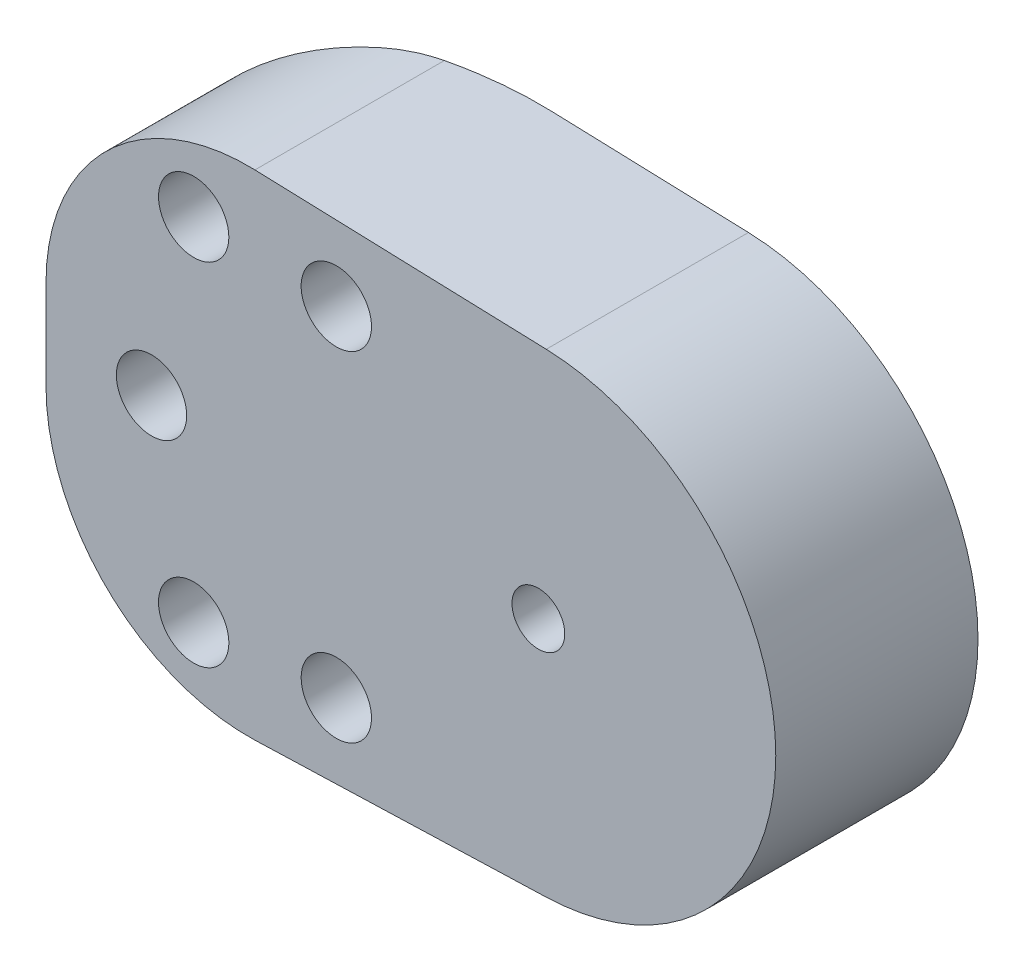
ISO-10303-21;
HEADER;
FILE_DESCRIPTION(('STEP AP214'),'2;1');
FILE_NAME('part.step','',(''),(''),'','','');
FILE_SCHEMA(('AUTOMOTIVE_DESIGN { 1 0 10303 214 1 1 1 1 }'));
ENDSEC;
DATA;
#1=APPLICATION_CONTEXT('core data for automotive mechanical design processes');
#2=APPLICATION_PROTOCOL_DEFINITION('international standard','automotive_design',2000,#1);
#3=PRODUCT_CONTEXT('',#1,'mechanical');
#4=PRODUCT('Part','Part','',(#3));
#5=PRODUCT_RELATED_PRODUCT_CATEGORY('part','',(#4));
#6=PRODUCT_DEFINITION_FORMATION('','',#4);
#7=PRODUCT_DEFINITION_CONTEXT('part definition',#1,'design');
#8=PRODUCT_DEFINITION('design','',#6,#7);
#9=PRODUCT_DEFINITION_SHAPE('','',#8);
#10=(LENGTH_UNIT() NAMED_UNIT(*) SI_UNIT(.MILLI.,.METRE.));
#11=(NAMED_UNIT(*) PLANE_ANGLE_UNIT() SI_UNIT($,.RADIAN.));
#12=(NAMED_UNIT(*) SI_UNIT($,.STERADIAN.) SOLID_ANGLE_UNIT());
#13=UNCERTAINTY_MEASURE_WITH_UNIT(LENGTH_MEASURE(1.E-05),#10,'distance_accuracy_value','');
#14=(GEOMETRIC_REPRESENTATION_CONTEXT(3) GLOBAL_UNCERTAINTY_ASSIGNED_CONTEXT((#13)) GLOBAL_UNIT_ASSIGNED_CONTEXT((#10,
#11,#12)) REPRESENTATION_CONTEXT('',''));
#15=CARTESIAN_POINT('',(0.,0.,0.));
#16=DIRECTION('',(0.,0.,1.));
#17=DIRECTION('',(1.,0.,0.));
#18=AXIS2_PLACEMENT_3D('',#15,#16,#17);
#19=CARTESIAN_POINT('',(0.447526725630509,-13.4925801768915,11.5));
#20=DIRECTION('',(-0.0331501278244821,0.999450383473447,0.));
#21=DIRECTION('',(-0.999450383473447,-0.0331501278244821,0.));
#22=AXIS2_PLACEMENT_3D('',#19,#20,#21);
#23=PLANE('',#22);
#24=DIRECTION('',(0.999450383473447,0.0331501278244821,0.));
#25=VECTOR('',#24,1.);
#26=CARTESIAN_POINT('',(0.447526725630509,-13.4925801768915,11.5));
#27=LINE('',#26,#25);
#28=CARTESIAN_POINT('',(-16.1187735300185,-14.0420571495702,11.5));
#29=VERTEX_POINT('',#28);
#30=CARTESIAN_POINT('',(0.447526725630504,-13.4925801768915,11.5));
#31=VERTEX_POINT('',#30);
#32=EDGE_CURVE('E132',#29,#31,#27,.T.);
#33=ORIENTED_EDGE('',*,*,#32,.F.);
#34=DIRECTION('',(0.,0.,-1.));
#35=VECTOR('',#34,1.);
#36=CARTESIAN_POINT('',(-16.1187735300185,-14.0420571495702,5.75));
#37=LINE('',#36,#35);
#38=CARTESIAN_POINT('',(-16.1187735300185,-14.0420571495702,0.727290334127259));
#39=VERTEX_POINT('',#38);
#40=EDGE_CURVE('E11',#29,#39,#37,.T.);
#41=ORIENTED_EDGE('',*,*,#40,.T.);
#42=CARTESIAN_POINT('',(-10.7743687797235,-13.864792021108,20.));
#43=DIRECTION('',(-0.0331501278244821,0.999450383473447,0.));
#44=DIRECTION('',(0.999450383473447,0.0331501278244821,0.));
#45=AXIS2_PLACEMENT_3D('',#42,#43,#44);
#46=ELLIPSE('',#45,20.01099837542,20.);
#47=CARTESIAN_POINT('',(-10.7743687797235,-13.864792021108,0.));
#48=VERTEX_POINT('',#47);
#49=EDGE_CURVE('E382',#39,#48,#46,.F.);
#50=ORIENTED_EDGE('',*,*,#49,.T.);
#51=DIRECTION('',(0.999450383473447,0.0331501278244821,0.));
#52=VECTOR('',#51,1.);
#53=CARTESIAN_POINT('',(0.447526725630509,-13.4925801768915,0.));
#54=LINE('',#53,#52);
#55=CARTESIAN_POINT('',(0.447526725630504,-13.4925801768915,0.));
#56=VERTEX_POINT('',#55);
#57=EDGE_CURVE('E154',#48,#56,#54,.T.);
#58=ORIENTED_EDGE('',*,*,#57,.T.);
#59=DIRECTION('',(0.,0.,-1.));
#60=VECTOR('',#59,1.);
#61=CARTESIAN_POINT('',(0.447526725630504,-13.4925801768915,11.5));
#62=LINE('',#61,#60);
#63=EDGE_CURVE('E147',#31,#56,#62,.T.);
#64=ORIENTED_EDGE('',*,*,#63,.F.);
#65=EDGE_LOOP('',(#33,#41,#50,#58,#64));
#66=FACE_BOUND('',#65,.T.);
#67=ADVANCED_FACE('F40',(#66),#23,.F.);
#68=CARTESIAN_POINT('',(0.,0.,11.5));
#69=DIRECTION('',(0.,0.,-1.));
#70=DIRECTION('',(-1.,0.,0.));
#71=AXIS2_PLACEMENT_3D('',#68,#69,#70);
#72=CYLINDRICAL_SURFACE('',#71,13.5);
#73=CARTESIAN_POINT('',(0.,0.,0.));
#74=DIRECTION('',(0.,0.,1.));
#75=DIRECTION('',(1.,0.,0.));
#76=AXIS2_PLACEMENT_3D('',#73,#74,#75);
#77=CIRCLE('',#76,13.5);
#78=CARTESIAN_POINT('',(0.447526725630531,13.4925801768915,0.));
#79=VERTEX_POINT('',#78);
#80=EDGE_CURVE('E487',#56,#79,#77,.T.);
#81=ORIENTED_EDGE('',*,*,#80,.T.);
#82=DIRECTION('',(0.,0.,-1.));
#83=VECTOR('',#82,1.);
#84=CARTESIAN_POINT('',(0.447526725630531,13.4925801768915,11.5));
#85=LINE('',#84,#83);
#86=CARTESIAN_POINT('',(0.447526725630531,13.4925801768915,11.5));
#87=VERTEX_POINT('',#86);
#88=EDGE_CURVE('E149',#87,#79,#85,.T.);
#89=ORIENTED_EDGE('',*,*,#88,.F.);
#90=CARTESIAN_POINT('',(0.,0.,11.5));
#91=DIRECTION('',(0.,0.,1.));
#92=DIRECTION('',(1.,0.,0.));
#93=AXIS2_PLACEMENT_3D('',#90,#91,#92);
#94=CIRCLE('',#93,13.5);
#95=EDGE_CURVE('E135',#31,#87,#94,.T.);
#96=ORIENTED_EDGE('',*,*,#95,.F.);
#97=ORIENTED_EDGE('',*,*,#63,.T.);
#98=EDGE_LOOP('',(#81,#89,#96,#97));
#99=FACE_BOUND('',#98,.T.);
#100=ADVANCED_FACE('F146',(#99),#72,.T.);
#101=CARTESIAN_POINT('',(0.447526725630505,13.4925801768915,11.5));
#102=DIRECTION('',(0.0331501278244818,0.999450383473447,0.));
#103=DIRECTION('',(-0.999450383473447,0.0331501278244818,0.));
#104=AXIS2_PLACEMENT_3D('',#101,#102,#103);
#105=PLANE('',#104);
#106=CARTESIAN_POINT('',(-10.7743687797235,13.864792021108,20.));
#107=DIRECTION('',(0.0331501278244818,0.999450383473447,0.));
#108=DIRECTION('',(-0.999450383473447,0.0331501278244818,0.));
#109=AXIS2_PLACEMENT_3D('',#106,#107,#108);
#110=ELLIPSE('',#109,20.01099837542,20.);
#111=CARTESIAN_POINT('',(-10.7743687797235,13.864792021108,0.));
#112=VERTEX_POINT('',#111);
#113=CARTESIAN_POINT('',(-16.1187735300184,14.0420571495702,0.727290334127259));
#114=VERTEX_POINT('',#113);
#115=EDGE_CURVE('E441',#112,#114,#110,.T.);
#116=ORIENTED_EDGE('',*,*,#115,.T.);
#117=DIRECTION('',(0.,0.,-1.));
#118=VECTOR('',#117,1.);
#119=CARTESIAN_POINT('',(-16.1187735300185,14.0420571495702,11.5));
#120=LINE('',#119,#118);
#121=CARTESIAN_POINT('',(-16.1187735300185,14.0420571495702,11.5));
#122=VERTEX_POINT('',#121);
#123=EDGE_CURVE('E66',#114,#122,#120,.F.);
#124=ORIENTED_EDGE('',*,*,#123,.T.);
#125=DIRECTION('',(0.999450383473447,-0.0331501278244818,0.));
#126=VECTOR('',#125,1.);
#127=CARTESIAN_POINT('',(0.447526725630505,13.4925801768915,11.5));
#128=LINE('',#127,#126);
#129=EDGE_CURVE('E151',#122,#87,#128,.T.);
#130=ORIENTED_EDGE('',*,*,#129,.T.);
#131=ORIENTED_EDGE('',*,*,#88,.T.);
#132=DIRECTION('',(0.999450383473447,-0.0331501278244818,0.));
#133=VECTOR('',#132,1.);
#134=CARTESIAN_POINT('',(0.447526725630505,13.4925801768915,0.));
#135=LINE('',#134,#133);
#136=EDGE_CURVE('E141',#112,#79,#135,.T.);
#137=ORIENTED_EDGE('',*,*,#136,.F.);
#138=EDGE_LOOP('',(#116,#124,#130,#131,#137));
#139=FACE_BOUND('',#138,.T.);
#140=ADVANCED_FACE('F222',(#139),#105,.T.);
#141=CARTESIAN_POINT('',(-28.,0.,11.5));
#142=DIRECTION('',(-1.,0.,0.));
#143=DIRECTION('',(0.,-1.,0.));
#144=AXIS2_PLACEMENT_3D('',#141,#142,#143);
#145=PLANE('',#144);
#146=DIRECTION('',(0.,1.,0.));
#147=VECTOR('',#146,1.);
#148=CARTESIAN_POINT('',(-28.,0.,11.5));
#149=LINE('',#148,#147);
#150=CARTESIAN_POINT('',(-28.,-2.54837773962556,11.5));
#151=VERTEX_POINT('',#150);
#152=CARTESIAN_POINT('',(-28.,2.54837773962556,11.5));
#153=VERTEX_POINT('',#152);
#154=EDGE_CURVE('E163',#151,#153,#149,.T.);
#155=ORIENTED_EDGE('',*,*,#154,.T.);
#156=DIRECTION('',(0.,0.,-1.));
#157=VECTOR('',#156,1.);
#158=CARTESIAN_POINT('',(-28.,2.54837773962556,11.5));
#159=LINE('',#158,#157);
#160=CARTESIAN_POINT('',(-28.,2.54837773962556,5.75));
#161=VERTEX_POINT('',#160);
#162=EDGE_CURVE('E388',#153,#161,#159,.T.);
#163=ORIENTED_EDGE('',*,*,#162,.T.);
#164=DIRECTION('',(0.,1.,0.));
#165=VECTOR('',#164,1.);
#166=CARTESIAN_POINT('',(-28.,-14.4361379190654,5.75));
#167=LINE('',#166,#165);
#168=CARTESIAN_POINT('',(-28.,-2.54837773962556,5.75));
#169=VERTEX_POINT('',#168);
#170=EDGE_CURVE('E171',#169,#161,#167,.T.);
#171=ORIENTED_EDGE('',*,*,#170,.F.);
#172=DIRECTION('',(0.,0.,-1.));
#173=VECTOR('',#172,1.);
#174=CARTESIAN_POINT('',(-28.,-2.54837773962556,11.5));
#175=LINE('',#174,#173);
#176=EDGE_CURVE('E385',#169,#151,#175,.F.);
#177=ORIENTED_EDGE('',*,*,#176,.T.);
#178=EDGE_LOOP('',(#155,#163,#171,#177));
#179=FACE_BOUND('',#178,.T.);
#180=ADVANCED_FACE('F215',(#179),#145,.T.);
#181=CARTESIAN_POINT('',(0.,0.,11.5));
#182=DIRECTION('',(0.,0.,1.));
#183=DIRECTION('',(1.,0.,0.));
#184=AXIS2_PLACEMENT_3D('',#181,#182,#183);
#185=PLANE('',#184);
#186=CARTESIAN_POINT('',(0.,0.,11.5));
#187=DIRECTION('',(0.,0.,-1.));
#188=DIRECTION('',(-1.,0.,0.));
#189=AXIS2_PLACEMENT_3D('',#186,#187,#188);
#190=CIRCLE('',#189,1.5);
#191=CARTESIAN_POINT('',(-1.5,0.,11.5));
#192=VERTEX_POINT('',#191);
#193=EDGE_CURVE('E527',#192,#192,#190,.T.);
#194=ORIENTED_EDGE('',*,*,#193,.T.);
#195=EDGE_LOOP('',(#194));
#196=FACE_BOUND('',#195,.T.);
#197=CARTESIAN_POINT('',(-11.4906666467847,-9.64181414529811,11.5));
#198=DIRECTION('',(0.,0.,1.));
#199=DIRECTION('',(-1.,0.,0.));
#200=AXIS2_PLACEMENT_3D('',#197,#198,#199);
#201=CIRCLE('',#200,2.);
#202=CARTESIAN_POINT('',(-13.4906666467847,-9.64181414529811,11.5));
#203=VERTEX_POINT('',#202);
#204=EDGE_CURVE('E475',#203,#203,#201,.T.);
#205=ORIENTED_EDGE('',*,*,#204,.F.);
#206=EDGE_LOOP('',(#205));
#207=FACE_BOUND('',#206,.T.);
#208=CARTESIAN_POINT('',(-19.6021435321441,-9.98779099427005,11.5));
#209=DIRECTION('',(0.,0.,1.));
#210=DIRECTION('',(-1.,0.,0.));
#211=AXIS2_PLACEMENT_3D('',#208,#209,#210);
#212=CIRCLE('',#211,2.);
#213=CARTESIAN_POINT('',(-21.6021435321441,-9.98779099427005,11.5));
#214=VERTEX_POINT('',#213);
#215=EDGE_CURVE('E465',#214,#214,#212,.T.);
#216=ORIENTED_EDGE('',*,*,#215,.F.);
#217=EDGE_LOOP('',(#216));
#218=FACE_BOUND('',#217,.T.);
#219=CARTESIAN_POINT('',(-11.4906666467847,9.6418141452981,11.5));
#220=DIRECTION('',(0.,0.,1.));
#221=DIRECTION('',(1.,0.,0.));
#222=AXIS2_PLACEMENT_3D('',#219,#220,#221);
#223=CIRCLE('',#222,2.);
#224=CARTESIAN_POINT('',(-9.49066664678466,9.6418141452981,11.5));
#225=VERTEX_POINT('',#224);
#226=EDGE_CURVE('E457',#225,#225,#223,.T.);
#227=ORIENTED_EDGE('',*,*,#226,.F.);
#228=EDGE_LOOP('',(#227));
#229=FACE_BOUND('',#228,.T.);
#230=CARTESIAN_POINT('',(-19.6021435321441,9.98779099427005,11.5));
#231=DIRECTION('',(0.,0.,1.));
#232=DIRECTION('',(1.,0.,0.));
#233=AXIS2_PLACEMENT_3D('',#230,#231,#232);
#234=CIRCLE('',#233,2.);
#235=CARTESIAN_POINT('',(-17.6021435321441,9.98779099427005,11.5));
#236=VERTEX_POINT('',#235);
#237=EDGE_CURVE('E456',#236,#236,#234,.T.);
#238=ORIENTED_EDGE('',*,*,#237,.F.);
#239=EDGE_LOOP('',(#238));
#240=FACE_BOUND('',#239,.T.);
#241=CARTESIAN_POINT('',(-22.,0.,11.5));
#242=DIRECTION('',(0.,0.,1.));
#243=DIRECTION('',(1.,0.,0.));
#244=AXIS2_PLACEMENT_3D('',#241,#242,#243);
#245=CIRCLE('',#244,2.);
#246=CARTESIAN_POINT('',(-20.,0.,11.5));
#247=VERTEX_POINT('',#246);
#248=EDGE_CURVE('E462',#247,#247,#245,.T.);
#249=ORIENTED_EDGE('',*,*,#248,.F.);
#250=EDGE_LOOP('',(#249));
#251=FACE_BOUND('',#250,.T.);
#252=ORIENTED_EDGE('',*,*,#129,.F.);
#253=CARTESIAN_POINT('',(-16.5,2.54837773962556,11.5));
#254=DIRECTION('',(0.,0.,1.));
#255=DIRECTION('',(1.,0.,0.));
#256=AXIS2_PLACEMENT_3D('',#253,#254,#255);
#257=CIRCLE('',#256,11.5);
#258=EDGE_CURVE('E51',#122,#153,#257,.T.);
#259=ORIENTED_EDGE('',*,*,#258,.T.);
#260=ORIENTED_EDGE('',*,*,#154,.F.);
#261=CARTESIAN_POINT('',(-16.5,-2.54837773962556,11.5));
#262=DIRECTION('',(0.,0.,1.));
#263=DIRECTION('',(1.,0.,0.));
#264=AXIS2_PLACEMENT_3D('',#261,#262,#263);
#265=CIRCLE('',#264,11.5);
#266=EDGE_CURVE('E58',#151,#29,#265,.T.);
#267=ORIENTED_EDGE('',*,*,#266,.T.);
#268=ORIENTED_EDGE('',*,*,#32,.T.);
#269=ORIENTED_EDGE('',*,*,#95,.T.);
#270=EDGE_LOOP('',(#252,#259,#260,#267,#268,#269));
#271=FACE_BOUND('',#270,.T.);
#272=ADVANCED_FACE('F134',(#196,#207,#218,#229,#240,#251,#271),#185,.T.);
#273=CARTESIAN_POINT('',(0.,0.,0.));
#274=DIRECTION('',(0.,0.,1.));
#275=DIRECTION('',(1.,0.,0.));
#276=AXIS2_PLACEMENT_3D('',#273,#274,#275);
#277=PLANE('',#276);
#278=CARTESIAN_POINT('',(0.,0.,0.));
#279=DIRECTION('',(0.,0.,-1.));
#280=DIRECTION('',(-1.,0.,0.));
#281=AXIS2_PLACEMENT_3D('',#278,#279,#280);
#282=CIRCLE('',#281,9.5);
#283=CARTESIAN_POINT('',(-9.5,0.,0.));
#284=VERTEX_POINT('',#283);
#285=EDGE_CURVE('E522',#284,#284,#282,.T.);
#286=ORIENTED_EDGE('',*,*,#285,.F.);
#287=EDGE_LOOP('',(#286));
#288=FACE_BOUND('',#287,.T.);
#289=ORIENTED_EDGE('',*,*,#57,.F.);
#290=DIRECTION('',(0.,1.,0.));
#291=VECTOR('',#290,1.);
#292=CARTESIAN_POINT('',(-10.7743687797235,0.,0.));
#293=LINE('',#292,#291);
#294=CARTESIAN_POINT('',(-10.7743687797235,-11.5091430840884,0.));
#295=VERTEX_POINT('',#294);
#296=EDGE_CURVE('E175',#48,#295,#293,.T.);
#297=ORIENTED_EDGE('',*,*,#296,.T.);
#298=CARTESIAN_POINT('',(-11.4906666467847,-9.64181414529811,0.));
#299=DIRECTION('',(0.,0.,1.));
#300=DIRECTION('',(-1.,0.,0.));
#301=AXIS2_PLACEMENT_3D('',#298,#299,#300);
#302=CIRCLE('',#301,2.);
#303=CARTESIAN_POINT('',(-10.7743687797235,-7.77448520650783,0.));
#304=VERTEX_POINT('',#303);
#305=EDGE_CURVE('E472',#295,#304,#302,.T.);
#306=ORIENTED_EDGE('',*,*,#305,.T.);
#307=DIRECTION('',(0.,1.,0.));
#308=VECTOR('',#307,1.);
#309=CARTESIAN_POINT('',(-10.7743687797235,0.,0.));
#310=LINE('',#309,#308);
#311=CARTESIAN_POINT('',(-10.7743687797235,7.77448520650783,0.));
#312=VERTEX_POINT('',#311);
#313=EDGE_CURVE('E161',#304,#312,#310,.T.);
#314=ORIENTED_EDGE('',*,*,#313,.T.);
#315=CARTESIAN_POINT('',(-11.4906666467847,9.6418141452981,0.));
#316=DIRECTION('',(0.,0.,1.));
#317=DIRECTION('',(1.,0.,0.));
#318=AXIS2_PLACEMENT_3D('',#315,#316,#317);
#319=CIRCLE('',#318,2.);
#320=CARTESIAN_POINT('',(-10.7743687797235,11.5091430840884,0.));
#321=VERTEX_POINT('',#320);
#322=EDGE_CURVE('E450',#312,#321,#319,.T.);
#323=ORIENTED_EDGE('',*,*,#322,.T.);
#324=DIRECTION('',(0.,1.,0.));
#325=VECTOR('',#324,1.);
#326=CARTESIAN_POINT('',(-10.7743687797235,0.,0.));
#327=LINE('',#326,#325);
#328=EDGE_CURVE('E157',#321,#112,#327,.T.);
#329=ORIENTED_EDGE('',*,*,#328,.T.);
#330=ORIENTED_EDGE('',*,*,#136,.T.);
#331=ORIENTED_EDGE('',*,*,#80,.F.);
#332=EDGE_LOOP('',(#289,#297,#306,#314,#323,#329,#330,#331));
#333=FACE_BOUND('',#332,.T.);
#334=ADVANCED_FACE('F211',(#288,#333),#277,.F.);
#335=CARTESIAN_POINT('',(-22.,0.,0.));
#336=DIRECTION('',(0.,0.,1.));
#337=DIRECTION('',(1.,0.,0.));
#338=AXIS2_PLACEMENT_3D('',#335,#336,#337);
#339=CYLINDRICAL_SURFACE('',#338,2.);
#340=CARTESIAN_POINT('',(-22.,0.,3.09615384615385));
#341=DIRECTION('',(0.404506014777703,0.,0.914535337758285));
#342=DIRECTION('',(-0.914535337758285,0.,0.404506014777703));
#343=AXIS2_PLACEMENT_3D('',#340,#341,#342);
#344=ELLIPSE('',#343,2.18690291935839,2.);
#345=CARTESIAN_POINT('',(-24.,0.,3.98076923076923));
#346=VERTEX_POINT('',#345);
#347=EDGE_CURVE('E479',#346,#346,#344,.F.);
#348=ORIENTED_EDGE('',*,*,#347,.T.);
#349=EDGE_LOOP('',(#348));
#350=FACE_BOUND('',#349,.T.);
#351=ORIENTED_EDGE('',*,*,#248,.T.);
#352=EDGE_LOOP('',(#351));
#353=FACE_BOUND('',#352,.T.);
#354=ADVANCED_FACE('F207',(#350,#353),#339,.F.);
#355=CARTESIAN_POINT('',(-19.6021435321441,9.98779099427005,0.));
#356=DIRECTION('',(0.,0.,1.));
#357=DIRECTION('',(1.,0.,0.));
#358=AXIS2_PLACEMENT_3D('',#355,#356,#357);
#359=CYLINDRICAL_SURFACE('',#358,2.);
#360=CARTESIAN_POINT('',(-19.6021435321441,9.98779099427005,2.03556348537142));
#361=DIRECTION('',(0.404506014777703,0.,0.914535337758285));
#362=DIRECTION('',(-0.914535337758285,0.,0.404506014777703));
#363=AXIS2_PLACEMENT_3D('',#360,#361,#362);
#364=ELLIPSE('',#363,2.18690291935838,2.);
#365=CARTESIAN_POINT('',(-18.8644890752775,8.1287950549886,1.7092932448343));
#366=VERTEX_POINT('',#365);
#367=CARTESIAN_POINT('',(-18.8644890752775,11.8467869335515,1.7092932448343));
#368=VERTEX_POINT('',#367);
#369=EDGE_CURVE('E170',#366,#368,#364,.F.);
#370=ORIENTED_EDGE('',*,*,#369,.T.);
#371=CARTESIAN_POINT('',(-18.8644890752775,11.8467869335515,1.7092932448343));
#372=CARTESIAN_POINT('',(-18.8130559216938,11.82637641856,1.68654269072783));
#373=CARTESIAN_POINT('',(-18.7622792001197,11.8037571543918,1.66434470869647));
#374=CARTESIAN_POINT('',(-18.6623677657706,11.7541259276472,1.62114180528035));
#375=CARTESIAN_POINT('',(-18.6132336555638,11.7271123739499,1.60013731977782));
#376=CARTESIAN_POINT('',(-18.4687062812776,11.6394581444725,1.53901171888708));
#377=CARTESIAN_POINT('',(-18.3763380719209,11.5722628388795,1.5008445213542));
#378=CARTESIAN_POINT('',(-18.2029715707146,11.4215129275508,1.4305447264895));
#379=CARTESIAN_POINT('',(-18.1220027013065,11.3379172745181,1.39842767536083));
#380=CARTESIAN_POINT('',(-17.975019619618,11.1565743764878,1.34103810320925));
#381=CARTESIAN_POINT('',(-17.908984522222,11.0588472123761,1.31575601358535));
#382=CARTESIAN_POINT('',(-17.7979399290964,10.8579971847009,1.27374072974097));
#383=CARTESIAN_POINT('',(-17.7519409758567,10.7555062168334,1.25660006108076));
#384=CARTESIAN_POINT('',(-17.6775902691445,10.5434118979839,1.22908844741668));
#385=CARTESIAN_POINT('',(-17.649240180037,10.433807877286,1.21871814088299));
#386=CARTESIAN_POINT('',(-17.6123536808723,10.2164595233752,1.20525794722578));
#387=CARTESIAN_POINT('',(-17.6029120220986,10.1088885030608,1.20183531885941));
#388=CARTESIAN_POINT('',(-17.6014657647837,9.89363370494854,1.20130989236668));
#389=CARTESIAN_POINT('',(-17.6094566001406,9.78594996406016,1.20420543931754));
#390=CARTESIAN_POINT('',(-17.6422683842184,9.57542017503546,1.21617061352568));
#391=CARTESIAN_POINT('',(-17.6668020269964,9.47252308390862,1.22513485368309));
#392=CARTESIAN_POINT('',(-17.7314742274658,9.27249735984786,1.24900369094485));
#393=CARTESIAN_POINT('',(-17.7716126776101,9.17536868716379,1.26390824710902));
#394=CARTESIAN_POINT('',(-17.8666215906705,8.98823394050866,1.29966453835229));
#395=CARTESIAN_POINT('',(-17.9216706880608,8.8983326016608,1.32058859129228));
#396=CARTESIAN_POINT('',(-18.0443257317865,8.72917066045712,1.3679835755938));
#397=CARTESIAN_POINT('',(-18.1119365201084,8.64991418159767,1.39445664636691));
#398=CARTESIAN_POINT('',(-18.2604949491185,8.50066994566908,1.45371824430107));
#399=CARTESIAN_POINT('',(-18.3418816497938,8.43120750553132,1.48672434891017));
#400=CARTESIAN_POINT('',(-18.5131466326556,8.30693981917915,1.55766086270393));
#401=CARTESIAN_POINT('',(-18.6030170728472,8.25212121296257,1.59558673617481));
#402=CARTESIAN_POINT('',(-18.7234100184551,8.19090589316487,1.647516189075));
#403=CARTESIAN_POINT('',(-18.7513397215753,8.17751755263959,1.6596378796333));
#404=CARTESIAN_POINT('',(-18.8076079503752,8.15212720428471,1.68421431168831));
#405=CARTESIAN_POINT('',(-18.8359456393652,8.14012271736677,1.69666840679291));
#406=CARTESIAN_POINT('',(-18.8644890752775,8.12879505498859,1.7092932448343));
#407=B_SPLINE_CURVE_WITH_KNOTS('',3,(#371,#372,#373,#374,#375,#376,#377,#378,#379,#380,#381,
#382,#383,#384,#385,#386,#387,#388,#389,#390,#391,#392,#393,#394,#395,#396,#397,#398,#399,#400,
#401,#402,#403,#404,#405,#406),.UNSPECIFIED.,.F.,.F.,(4,2,2,2,2,2,2,2,2,2,2,2,2,2,2,2,2,4),(0.,
0.179394468214409,0.358854038253497,0.718289694969715,1.07863670694364,1.43847660782962,
1.77765747550158,2.11687032456441,2.43941300691122,2.7618712156355,3.078868665351,
3.39586393038454,3.71683909402883,4.03793823731502,4.37244728771783,4.70665010520535,
4.80640998315996,4.90598827498909),.UNSPECIFIED.);
#408=EDGE_CURVE('E365',#368,#366,#407,.T.);
#409=ORIENTED_EDGE('',*,*,#408,.T.);
#410=EDGE_LOOP('',(#370,#409));
#411=FACE_BOUND('',#410,.T.);
#412=ORIENTED_EDGE('',*,*,#237,.T.);
#413=EDGE_LOOP('',(#412));
#414=FACE_BOUND('',#413,.T.);
#415=ADVANCED_FACE('F210',(#411,#414),#359,.F.);
#416=CARTESIAN_POINT('',(-11.4906666467847,9.6418141452981,0.));
#417=DIRECTION('',(0.,0.,1.));
#418=DIRECTION('',(1.,0.,0.));
#419=AXIS2_PLACEMENT_3D('',#416,#417,#418);
#420=CYLINDRICAL_SURFACE('',#419,2.);
#421=ORIENTED_EDGE('',*,*,#322,.F.);
#422=CARTESIAN_POINT('',(-10.7743687797235,7.77448520650783,0.));
#423=CARTESIAN_POINT('',(-10.8267070901797,7.75440875867114,-9.78120700250471E-07));
#424=CARTESIAN_POINT('',(-10.87986493512,7.73654324278459,0.000205754939826786));
#425=CARTESIAN_POINT('',(-10.9874856525096,7.70533511704415,0.00106319344824456));
#426=CARTESIAN_POINT('',(-11.0419484600332,7.69199228267114,0.00171387685231044));
#427=CARTESIAN_POINT('',(-11.2066069044603,7.65893569931774,0.00437156507126425));
#428=CARTESIAN_POINT('',(-11.3182600154421,7.64612218730669,0.00708400538869053));
#429=CARTESIAN_POINT('',(-11.5420669124996,7.63933683746181,0.014425110743439));
#430=CARTESIAN_POINT('',(-11.6542209030709,7.64537356596286,0.019054646159517));
#431=CARTESIAN_POINT('',(-11.8758564296802,7.67607350944464,0.0300468319068131));
#432=CARTESIAN_POINT('',(-11.9853383781684,7.70073383071805,0.0364092128927713));
#433=CARTESIAN_POINT('',(-12.1987887801302,7.76801739946622,0.0505011828140889));
#434=CARTESIAN_POINT('',(-12.3027452617263,7.8106779933289,0.0582335947861854));
#435=CARTESIAN_POINT('',(-12.5020350343038,7.91274791121235,0.074509342526142));
#436=CARTESIAN_POINT('',(-12.5973666696396,7.97216044200143,0.0830528333482623));
#437=CARTESIAN_POINT('',(-12.7772820279376,8.10646522680365,0.100337511855809));
#438=CARTESIAN_POINT('',(-12.8617994401964,8.18144621942675,0.109079565110999));
#439=CARTESIAN_POINT('',(-13.0170530951337,8.34457763186573,0.125984821904927));
#440=CARTESIAN_POINT('',(-13.0877900514727,8.43272736928244,0.134148055405574));
#441=CARTESIAN_POINT('',(-13.2135400751817,8.61984264323843,0.149194684400897));
#442=CARTESIAN_POINT('',(-13.2685369263698,8.71881919003193,0.156076757452462));
#443=CARTESIAN_POINT('',(-13.3610992759895,8.92472194258012,0.167929631836415));
#444=CARTESIAN_POINT('',(-13.3986651902241,9.03164795863505,0.172900478759312));
#445=CARTESIAN_POINT('',(-13.4550446443995,9.24963282621778,0.18044431431827));
#446=CARTESIAN_POINT('',(-13.4739849978138,9.36065831301407,0.183033510674396));
#447=CARTESIAN_POINT('',(-13.4929887479137,9.58434011141885,0.185631454329558));
#448=CARTESIAN_POINT('',(-13.493053156147,9.69699633531379,0.185640339905509));
#449=CARTESIAN_POINT('',(-13.4743688837826,9.91994420525529,0.183085916267464));
#450=CARTESIAN_POINT('',(-13.4557460696967,10.0302466287223,0.180539815982934));
#451=CARTESIAN_POINT('',(-13.4004327408505,10.2461415621403,0.173135418822681));
#452=CARTESIAN_POINT('',(-13.3637419338227,10.3517339958722,0.168277084544335));
#453=CARTESIAN_POINT('',(-13.2732703611041,10.5554740112158,0.156674583071051));
#454=CARTESIAN_POINT('',(-13.2194539869242,10.6536055482187,0.149926490117625));
#455=CARTESIAN_POINT('',(-13.0962929742222,10.8394764064301,0.135144057943756));
#456=CARTESIAN_POINT('',(-13.0269476694171,10.9272152814847,0.127109663537586));
#457=CARTESIAN_POINT('',(-12.8740414727114,11.0905692848549,0.110371473716189));
#458=CARTESIAN_POINT('',(-12.7903694833423,11.1660799357513,0.101662762663407));
#459=CARTESIAN_POINT('',(-12.6115422392447,11.3020106436761,0.084356666733446));
#460=CARTESIAN_POINT('',(-12.5163867573724,11.3624304021337,0.0757592840620707));
#461=CARTESIAN_POINT('',(-12.3168406107592,11.4666863645167,0.0593172021810791));
#462=CARTESIAN_POINT('',(-12.2124148695294,11.5104559554087,0.0514756181627169));
#463=CARTESIAN_POINT('',(-11.997577911509,11.5797975942907,0.0371510573972598));
#464=CARTESIAN_POINT('',(-11.8871660050691,11.6053675407358,0.0306682376100106));
#465=CARTESIAN_POINT('',(-11.6639370582717,11.6374731108989,0.0194815434934755));
#466=CARTESIAN_POINT('',(-11.5511300161897,11.6440763893516,0.0147713983701553));
#467=CARTESIAN_POINT('',(-11.3259954530759,11.6381942675747,0.00729236656463181));
#468=CARTESIAN_POINT('',(-11.2136675848046,11.6257265330457,0.00452168679751802));
#469=CARTESIAN_POINT('',(-11.0471738050428,11.5928642425627,0.00178126036366355));
#470=CARTESIAN_POINT('',(-10.9915720410888,11.5793835437885,0.00110415180433276));
#471=CARTESIAN_POINT('',(-10.8818212569441,11.5477417206697,0.000213386734324769));
#472=CARTESIAN_POINT('',(-10.8276698000594,11.5295890719608,-1.10249734999618E-06));
#473=CARTESIAN_POINT('',(-10.7743687797235,11.5091430840884,0.));
#474=B_SPLINE_CURVE_WITH_KNOTS('',3,(#422,#423,#424,#425,#426,#427,#428,#429,#430,#431,#432,
#433,#434,#435,#436,#437,#438,#439,#440,#441,#442,#443,#444,#445,#446,#447,#448,#449,#450,#451,
#452,#453,#454,#455,#456,#457,#458,#459,#460,#461,#462,#463,#464,#465,#466,#467,#468,#469,#470,
#471,#472,#473),.UNSPECIFIED.,.F.,.F.,(4,2,2,2,2,2,2,2,2,2,2,2,2,2,2,2,2,2,2,2,2,2,2,2,2,4),(0.,
0.168067284393168,0.336126224213032,0.67164970901536,1.00732569185909,1.3429495285748,
1.6792731577288,2.01566121197183,2.3540220392235,2.69236533882846,3.03105597073665,
3.36973852299595,3.70609882678881,4.04244110528264,4.37653307818202,4.71063045552596,
5.0454270974001,5.38023810678447,5.71777389912415,6.05531636902445,6.39419540183771,
6.73311355926112,7.07082127387582,7.40821635530031,7.57968204195135,7.75083882958931),.UNSPECIFIED.);
#475=EDGE_CURVE('E188',#312,#321,#474,.T.);
#476=ORIENTED_EDGE('',*,*,#475,.T.);
#477=EDGE_LOOP('',(#421,#476));
#478=FACE_BOUND('',#477,.T.);
#479=ORIENTED_EDGE('',*,*,#226,.T.);
#480=EDGE_LOOP('',(#479));
#481=FACE_BOUND('',#480,.T.);
#482=ADVANCED_FACE('F270',(#478,#481),#420,.F.);
#483=CARTESIAN_POINT('',(-19.6021435321441,-9.98779099427005,0.));
#484=DIRECTION('',(0.,0.,1.));
#485=DIRECTION('',(1.,0.,0.));
#486=AXIS2_PLACEMENT_3D('',#483,#484,#485);
#487=CYLINDRICAL_SURFACE('',#486,2.);
#488=CARTESIAN_POINT('',(-19.6021435321441,-9.98779099427005,2.03556348537142));
#489=DIRECTION('',(0.404506014777703,0.,0.914535337758285));
#490=DIRECTION('',(-0.914535337758285,0.,0.404506014777703));
#491=AXIS2_PLACEMENT_3D('',#488,#489,#490);
#492=ELLIPSE('',#491,2.18690291935838,2.);
#493=CARTESIAN_POINT('',(-18.8644890752775,-11.8467869335515,1.7092932448343));
#494=VERTEX_POINT('',#493);
#495=CARTESIAN_POINT('',(-18.8644890752775,-8.1287950549886,1.7092932448343));
#496=VERTEX_POINT('',#495);
#497=EDGE_CURVE('E167',#494,#496,#492,.F.);
#498=ORIENTED_EDGE('',*,*,#497,.T.);
#499=CARTESIAN_POINT('',(-18.8644890752775,-8.1287950549886,1.7092932448343));
#500=CARTESIAN_POINT('',(-18.8130559216938,-8.14920556998014,1.68654269072783));
#501=CARTESIAN_POINT('',(-18.7622792001197,-8.17182483414833,1.66434470869647));
#502=CARTESIAN_POINT('',(-18.6623677657706,-8.22145606089287,1.62114180528035));
#503=CARTESIAN_POINT('',(-18.6132336555638,-8.24846961459015,1.60013731977782));
#504=CARTESIAN_POINT('',(-18.4687062812776,-8.33612384406758,1.53901171888708));
#505=CARTESIAN_POINT('',(-18.3763380719209,-8.40331914966063,1.5008445213542));
#506=CARTESIAN_POINT('',(-18.2029715707146,-8.5540690609893,1.4305447264895));
#507=CARTESIAN_POINT('',(-18.1220027013065,-8.637664714022,1.39842767536083));
#508=CARTESIAN_POINT('',(-17.975019619618,-8.81900761205229,1.34103810320925));
#509=CARTESIAN_POINT('',(-17.908984522222,-8.91673477616397,1.31575601358535));
#510=CARTESIAN_POINT('',(-17.7979399290964,-9.11758480383921,1.27374072974097));
#511=CARTESIAN_POINT('',(-17.7519409758567,-9.22007577170673,1.25660006108076));
#512=CARTESIAN_POINT('',(-17.6775902691445,-9.4321700905562,1.22908844741668));
#513=CARTESIAN_POINT('',(-17.649240180037,-9.54177411125411,1.21871814088299));
#514=CARTESIAN_POINT('',(-17.6123536808723,-9.75912246516486,1.20525794722578));
#515=CARTESIAN_POINT('',(-17.6029120220986,-9.86669348547927,1.20183531885941));
#516=CARTESIAN_POINT('',(-17.6014657647837,-10.0819482835916,1.20130989236668));
#517=CARTESIAN_POINT('',(-17.6094566001406,-10.1896320244799,1.20420543931754));
#518=CARTESIAN_POINT('',(-17.6422683842184,-10.4001618135046,1.21617061352568));
#519=CARTESIAN_POINT('',(-17.6668020269964,-10.5030589046315,1.22513485368309));
#520=CARTESIAN_POINT('',(-17.7314742274658,-10.7030846286922,1.24900369094485));
#521=CARTESIAN_POINT('',(-17.7716126776101,-10.8002133013763,1.26390824710902));
#522=CARTESIAN_POINT('',(-17.8666215906705,-10.9873480480314,1.29966453835229));
#523=CARTESIAN_POINT('',(-17.9216706880608,-11.0772493868793,1.32058859129228));
#524=CARTESIAN_POINT('',(-18.0443257317865,-11.246411328083,1.3679835755938));
#525=CARTESIAN_POINT('',(-18.1119365201084,-11.3256678069424,1.39445664636691));
#526=CARTESIAN_POINT('',(-18.2604949491185,-11.474912042871,1.45371824430107));
#527=CARTESIAN_POINT('',(-18.3418816497938,-11.5443744830088,1.48672434891017));
#528=CARTESIAN_POINT('',(-18.5131466326556,-11.6686421693609,1.55766086270393));
#529=CARTESIAN_POINT('',(-18.6030170728472,-11.7234607755775,1.59558673617481));
#530=CARTESIAN_POINT('',(-18.7234100184551,-11.7846760953752,1.647516189075));
#531=CARTESIAN_POINT('',(-18.7513397215753,-11.7980644359005,1.6596378796333));
#532=CARTESIAN_POINT('',(-18.8076079503752,-11.8234547842554,1.68421431168831));
#533=CARTESIAN_POINT('',(-18.8359456393652,-11.8354592711733,1.69666840679291));
#534=CARTESIAN_POINT('',(-18.8644890752775,-11.8467869335515,1.7092932448343));
#535=B_SPLINE_CURVE_WITH_KNOTS('',3,(#499,#500,#501,#502,#503,#504,#505,#506,#507,#508,#509,
#510,#511,#512,#513,#514,#515,#516,#517,#518,#519,#520,#521,#522,#523,#524,#525,#526,#527,#528,
#529,#530,#531,#532,#533,#534),.UNSPECIFIED.,.F.,.F.,(4,2,2,2,2,2,2,2,2,2,2,2,2,2,2,2,2,4),(0.,
0.179394468214409,0.358854038253497,0.718289694969715,1.07863670694364,1.43847660782962,
1.77765747550158,2.11687032456441,2.43941300691122,2.7618712156355,3.07886866535099,
3.39586393038454,3.71683909402883,4.03793823731502,4.37244728771783,4.70665010520535,
4.80640998315996,4.90598827498909),.UNSPECIFIED.);
#536=EDGE_CURVE('E373',#496,#494,#535,.T.);
#537=ORIENTED_EDGE('',*,*,#536,.T.);
#538=EDGE_LOOP('',(#498,#537));
#539=FACE_BOUND('',#538,.T.);
#540=ORIENTED_EDGE('',*,*,#215,.T.);
#541=EDGE_LOOP('',(#540));
#542=FACE_BOUND('',#541,.T.);
#543=ADVANCED_FACE('F204',(#539,#542),#487,.F.);
#544=CARTESIAN_POINT('',(-11.4906666467847,-9.64181414529811,0.));
#545=DIRECTION('',(0.,0.,1.));
#546=DIRECTION('',(1.,0.,0.));
#547=AXIS2_PLACEMENT_3D('',#544,#545,#546);
#548=CYLINDRICAL_SURFACE('',#547,2.);
#549=ORIENTED_EDGE('',*,*,#305,.F.);
#550=CARTESIAN_POINT('',(-10.7743687797235,-11.5091430840884,0.));
#551=CARTESIAN_POINT('',(-10.8267070901797,-11.5292195319251,-9.78120700237135E-07));
#552=CARTESIAN_POINT('',(-10.8798649351199,-11.5470850478116,0.000205754939826797));
#553=CARTESIAN_POINT('',(-10.9874856525096,-11.5782931735521,0.00106319344824456));
#554=CARTESIAN_POINT('',(-11.0419484600332,-11.5916360079251,0.00171387685231044));
#555=CARTESIAN_POINT('',(-11.2066069044603,-11.6246925912785,0.00437156507126427));
#556=CARTESIAN_POINT('',(-11.3182600154421,-11.6375061032895,0.00708400538869059));
#557=CARTESIAN_POINT('',(-11.5420669124996,-11.6442914531344,0.014425110743439));
#558=CARTESIAN_POINT('',(-11.6542209030709,-11.6382547246334,0.019054646159517));
#559=CARTESIAN_POINT('',(-11.8758564296802,-11.6075547811516,0.0300468319068131));
#560=CARTESIAN_POINT('',(-11.9853383781684,-11.5828944598782,0.0364092128927713));
#561=CARTESIAN_POINT('',(-12.1987887801302,-11.51561089113,0.0505011828140891));
#562=CARTESIAN_POINT('',(-12.3027452617263,-11.4729502972673,0.0582335947861856));
#563=CARTESIAN_POINT('',(-12.5020350343038,-11.3708803793839,0.0745093425261422));
#564=CARTESIAN_POINT('',(-12.5973666696396,-11.3114678485948,0.0830528333482624));
#565=CARTESIAN_POINT('',(-12.7772820279376,-11.1771630637926,0.100337511855809));
#566=CARTESIAN_POINT('',(-12.8617994401964,-11.1021820711695,0.109079565110999));
#567=CARTESIAN_POINT('',(-13.0170530951337,-10.9390506587305,0.125984821904927));
#568=CARTESIAN_POINT('',(-13.0877900514727,-10.8509009213138,0.134148055405574));
#569=CARTESIAN_POINT('',(-13.2135400751817,-10.6637856473578,0.149194684400897));
#570=CARTESIAN_POINT('',(-13.2685369263698,-10.5648091005643,0.156076757452462));
#571=CARTESIAN_POINT('',(-13.3610992759895,-10.3589063480161,0.167929631836415));
#572=CARTESIAN_POINT('',(-13.3986651902241,-10.2519803319612,0.172900478759312));
#573=CARTESIAN_POINT('',(-13.4550446443995,-10.0339954643784,0.18044431431827));
#574=CARTESIAN_POINT('',(-13.4739849978138,-9.92296997758213,0.183033510674396));
#575=CARTESIAN_POINT('',(-13.4929887479137,-9.69928817917736,0.185631454329558));
#576=CARTESIAN_POINT('',(-13.493053156147,-9.58663195528241,0.185640339905509));
#577=CARTESIAN_POINT('',(-13.4743688837826,-9.36368408534091,0.183085916267463));
#578=CARTESIAN_POINT('',(-13.4557460696967,-9.25338166187386,0.180539815982933));
#579=CARTESIAN_POINT('',(-13.4004327408505,-9.03748672845595,0.17313541882268));
#580=CARTESIAN_POINT('',(-13.3637419338227,-8.93189429472396,0.168277084544335));
#581=CARTESIAN_POINT('',(-13.2732703611041,-8.72815427938039,0.156674583071049));
#582=CARTESIAN_POINT('',(-13.2194539869242,-8.63002274237747,0.149926490117621));
#583=CARTESIAN_POINT('',(-13.0962929742222,-8.44415188416615,0.135144057943752));
#584=CARTESIAN_POINT('',(-13.0269476694171,-8.35641300911148,0.127109663537585));
#585=CARTESIAN_POINT('',(-12.8740414727114,-8.19305900574135,0.110371473716188));
#586=CARTESIAN_POINT('',(-12.7903694833423,-8.11754835484493,0.101662762663405));
#587=CARTESIAN_POINT('',(-12.6115422392447,-7.9816176469201,0.0843566667334418));
#588=CARTESIAN_POINT('',(-12.5163867573724,-7.92119788846248,0.0757592840620654));
#589=CARTESIAN_POINT('',(-12.3168406107592,-7.81694192607949,0.0593172021810757));
#590=CARTESIAN_POINT('',(-12.2124148695294,-7.77317233518748,0.0514756181627166));
#591=CARTESIAN_POINT('',(-11.997577911509,-7.70383069630554,0.0371510573972609));
#592=CARTESIAN_POINT('',(-11.8871660050691,-7.67826074986043,0.0306682376100101));
#593=CARTESIAN_POINT('',(-11.6639370582717,-7.64615517969734,0.0194815434934745));
#594=CARTESIAN_POINT('',(-11.5511300161896,-7.63955190124464,0.0147713983701554));
#595=CARTESIAN_POINT('',(-11.3259954530759,-7.64543402302154,0.00729236656463258));
#596=CARTESIAN_POINT('',(-11.2136675848046,-7.6579017575505,0.00452168679751835));
#597=CARTESIAN_POINT('',(-11.0471738050428,-7.69076404803351,0.00178126036366289));
#598=CARTESIAN_POINT('',(-10.9915720410888,-7.70424474680776,0.00110415180433172));
#599=CARTESIAN_POINT('',(-10.8818212569441,-7.73588656992651,0.000213386734322739));
#600=CARTESIAN_POINT('',(-10.8276698000594,-7.75403921863536,-1.10249735264575E-06));
#601=CARTESIAN_POINT('',(-10.7743687797235,-7.77448520650783,0.));
#602=B_SPLINE_CURVE_WITH_KNOTS('',3,(#550,#551,#552,#553,#554,#555,#556,#557,#558,#559,#560,
#561,#562,#563,#564,#565,#566,#567,#568,#569,#570,#571,#572,#573,#574,#575,#576,#577,#578,#579,
#580,#581,#582,#583,#584,#585,#586,#587,#588,#589,#590,#591,#592,#593,#594,#595,#596,#597,#598,
#599,#600,#601),.UNSPECIFIED.,.F.,.F.,(4,2,2,2,2,2,2,2,2,2,2,2,2,2,2,2,2,2,2,2,2,2,2,2,2,4),(0.,
0.168067284393164,0.33612622421303,0.671649709015361,1.0073256918591,1.3429495285748,
1.67927315772881,2.01566121197183,2.3540220392235,2.69236533882846,3.03105597073666,
3.36973852299595,3.70609882678881,4.04244110528264,4.37653307818202,4.71063045552596,
5.0454270974001,5.38023810678447,5.71777389912415,6.05531636902445,6.39419540183771,
6.73311355926113,7.07082127387582,7.40821635530032,7.57968204195135,7.7508388295893),.UNSPECIFIED.);
#603=EDGE_CURVE('E179',#295,#304,#602,.T.);
#604=ORIENTED_EDGE('',*,*,#603,.T.);
#605=EDGE_LOOP('',(#549,#604));
#606=FACE_BOUND('',#605,.T.);
#607=ORIENTED_EDGE('',*,*,#204,.T.);
#608=EDGE_LOOP('',(#607));
#609=FACE_BOUND('',#608,.T.);
#610=ADVANCED_FACE('F198',(#606,#609),#548,.F.);
#611=CARTESIAN_POINT('',(-15.,-14.4361379190654,0.));
#612=DIRECTION('',(0.404506014777703,0.,0.914535337758285));
#613=DIRECTION('',(0.914535337758285,0.,-0.404506014777703));
#614=AXIS2_PLACEMENT_3D('',#611,#612,#613);
#615=PLANE('',#614);
#616=ORIENTED_EDGE('',*,*,#170,.T.);
#617=CARTESIAN_POINT('',(-16.5,2.54837773962556,0.663461538461542));
#618=DIRECTION('',(0.404506014777703,0.,0.914535337758285));
#619=DIRECTION('',(0.914535337758285,0.,-0.404506014777703));
#620=AXIS2_PLACEMENT_3D('',#617,#618,#619);
#621=ELLIPSE('',#620,12.5746917863107,11.5);
#622=CARTESIAN_POINT('',(-18.8644890752775,13.8026743152847,1.7092932448343));
#623=VERTEX_POINT('',#622);
#624=EDGE_CURVE('E395',#161,#623,#621,.F.);
#625=ORIENTED_EDGE('',*,*,#624,.T.);
#626=DIRECTION('',(0.,1.,0.));
#627=VECTOR('',#626,1.);
#628=CARTESIAN_POINT('',(-18.8644890752775,-14.4361379190654,1.7092932448343));
#629=LINE('',#628,#627);
#630=EDGE_CURVE('E374',#623,#368,#629,.F.);
#631=ORIENTED_EDGE('',*,*,#630,.T.);
#632=ORIENTED_EDGE('',*,*,#369,.F.);
#633=DIRECTION('',(0.,1.,0.));
#634=VECTOR('',#633,1.);
#635=CARTESIAN_POINT('',(-18.8644890752775,-14.4361379190654,1.7092932448343));
#636=LINE('',#635,#634);
#637=EDGE_CURVE('E435',#366,#496,#636,.F.);
#638=ORIENTED_EDGE('',*,*,#637,.T.);
#639=ORIENTED_EDGE('',*,*,#497,.F.);
#640=DIRECTION('',(0.,1.,0.));
#641=VECTOR('',#640,1.);
#642=CARTESIAN_POINT('',(-18.8644890752775,-14.4361379190654,1.7092932448343));
#643=LINE('',#642,#641);
#644=CARTESIAN_POINT('',(-18.8644890752775,-13.8026743152847,1.7092932448343));
#645=VERTEX_POINT('',#644);
#646=EDGE_CURVE('E437',#494,#645,#643,.F.);
#647=ORIENTED_EDGE('',*,*,#646,.T.);
#648=CARTESIAN_POINT('',(-16.5,-2.54837773962556,0.663461538461542));
#649=DIRECTION('',(0.404506014777703,0.,0.914535337758285));
#650=DIRECTION('',(-0.914535337758285,0.,0.404506014777703));
#651=AXIS2_PLACEMENT_3D('',#648,#649,#650);
#652=ELLIPSE('',#651,12.5746917863107,11.5);
#653=EDGE_CURVE('E392',#645,#169,#652,.F.);
#654=ORIENTED_EDGE('',*,*,#653,.T.);
#655=EDGE_LOOP('',(#616,#625,#631,#632,#638,#639,#647,#654));
#656=FACE_BOUND('',#655,.T.);
#657=ORIENTED_EDGE('',*,*,#347,.F.);
#658=EDGE_LOOP('',(#657));
#659=FACE_BOUND('',#658,.T.);
#660=ADVANCED_FACE('F203',(#656,#659),#615,.F.);
#661=CARTESIAN_POINT('',(-10.7743687797235,0.,20.));
#662=DIRECTION('',(0.,1.,0.));
#663=DIRECTION('',(0.,0.,1.));
#664=AXIS2_PLACEMENT_3D('',#661,#662,#663);
#665=CYLINDRICAL_SURFACE('',#664,20.);
#666=ORIENTED_EDGE('',*,*,#630,.F.);
#667=CARTESIAN_POINT('',(-18.8644890752775,13.8026743152847,1.7092932448343));
#668=CARTESIAN_POINT('',(-18.6444214421971,13.8489203040867,1.61193749012695));
#669=CARTESIAN_POINT('',(-18.4214692028999,13.8890105242969,1.51809147567523));
#670=CARTESIAN_POINT('',(-17.9716149898611,13.9560851387757,1.33833067308545));
#671=CARTESIAN_POINT('',(-17.7447345991513,13.9831261803973,1.25238293934199));
#672=CARTESIAN_POINT('',(-17.2868854624737,14.0237257613882,1.08846306817723));
#673=CARTESIAN_POINT('',(-17.0559164454307,14.0372834033767,1.01049146191276));
#674=CARTESIAN_POINT('',(-16.5899051231685,14.0504032540885,0.862607777896022));
#675=CARTESIAN_POINT('',(-16.3548493664313,14.0499036162083,0.792732674214914));
#676=CARTESIAN_POINT('',(-16.1187735300185,14.0420571495702,0.72729033412726));
#677=B_SPLINE_CURVE_WITH_KNOTS('',3,(#667,#668,#669,#670,#671,#672,#673,#674,#675,#676),
.UNSPECIFIED.,.F.,.F.,(4,2,2,2,4),(0.,0.735063617980648,1.46690691143785,2.19879890908805,
2.93391145040015),.UNSPECIFIED.);
#678=EDGE_CURVE('E405',#623,#114,#677,.T.);
#679=ORIENTED_EDGE('',*,*,#678,.T.);
#680=ORIENTED_EDGE('',*,*,#115,.F.);
#681=ORIENTED_EDGE('',*,*,#328,.F.);
#682=ORIENTED_EDGE('',*,*,#475,.F.);
#683=ORIENTED_EDGE('',*,*,#313,.F.);
#684=ORIENTED_EDGE('',*,*,#603,.F.);
#685=ORIENTED_EDGE('',*,*,#296,.F.);
#686=ORIENTED_EDGE('',*,*,#49,.F.);
#687=CARTESIAN_POINT('',(-16.1187735300185,-14.0420571495702,0.727290334127263));
#688=CARTESIAN_POINT('',(-16.3548493664313,-14.0499036162083,0.792732674214916));
#689=CARTESIAN_POINT('',(-16.5899051231685,-14.0504032540885,0.862607777896023));
#690=CARTESIAN_POINT('',(-17.0559164454307,-14.0372834033767,1.01049146191276));
#691=CARTESIAN_POINT('',(-17.2868854624737,-14.0237257613882,1.08846306817723));
#692=CARTESIAN_POINT('',(-17.7447345991513,-13.9831261803973,1.25238293934199));
#693=CARTESIAN_POINT('',(-17.9716149898611,-13.9560851387757,1.33833067308545));
#694=CARTESIAN_POINT('',(-18.4214692028999,-13.8890105242969,1.51809147567523));
#695=CARTESIAN_POINT('',(-18.6444214421971,-13.8489203040868,1.61193749012695));
#696=CARTESIAN_POINT('',(-18.8644890752776,-13.8026743152847,1.7092932448343));
#697=B_SPLINE_CURVE_WITH_KNOTS('',3,(#687,#688,#689,#690,#691,#692,#693,#694,#695,#696),
.UNSPECIFIED.,.F.,.F.,(4,2,2,2,4),(0.,0.735112541312104,1.4670045389623,2.1988478324195,
2.93391145040015),.UNSPECIFIED.);
#698=EDGE_CURVE('E398',#39,#645,#697,.T.);
#699=ORIENTED_EDGE('',*,*,#698,.T.);
#700=ORIENTED_EDGE('',*,*,#646,.F.);
#701=ORIENTED_EDGE('',*,*,#536,.F.);
#702=ORIENTED_EDGE('',*,*,#637,.F.);
#703=ORIENTED_EDGE('',*,*,#408,.F.);
#704=EDGE_LOOP('',(#666,#679,#680,#681,#682,#683,#684,#685,#686,#699,#700,#701,#702,#703));
#705=FACE_BOUND('',#704,.T.);
#706=ADVANCED_FACE('F195',(#705),#665,.T.);
#707=CARTESIAN_POINT('',(-16.5,2.54837773962556,11.5));
#708=DIRECTION('',(0.,0.,-1.));
#709=DIRECTION('',(-1.,0.,0.));
#710=AXIS2_PLACEMENT_3D('',#707,#708,#709);
#711=CYLINDRICAL_SURFACE('',#710,11.5);
#712=ORIENTED_EDGE('',*,*,#258,.F.);
#713=ORIENTED_EDGE('',*,*,#123,.F.);
#714=ORIENTED_EDGE('',*,*,#678,.F.);
#715=ORIENTED_EDGE('',*,*,#624,.F.);
#716=ORIENTED_EDGE('',*,*,#162,.F.);
#717=EDGE_LOOP('',(#712,#713,#714,#715,#716));
#718=FACE_BOUND('',#717,.T.);
#719=ADVANCED_FACE('F299',(#718),#711,.T.);
#720=CARTESIAN_POINT('',(-16.5,-2.54837773962556,11.5));
#721=DIRECTION('',(0.,0.,1.));
#722=DIRECTION('',(1.,0.,0.));
#723=AXIS2_PLACEMENT_3D('',#720,#721,#722);
#724=CYLINDRICAL_SURFACE('',#723,11.5);
#725=ORIENTED_EDGE('',*,*,#266,.F.);
#726=ORIENTED_EDGE('',*,*,#176,.F.);
#727=ORIENTED_EDGE('',*,*,#653,.F.);
#728=ORIENTED_EDGE('',*,*,#698,.F.);
#729=ORIENTED_EDGE('',*,*,#40,.F.);
#730=EDGE_LOOP('',(#725,#726,#727,#728,#729));
#731=FACE_BOUND('',#730,.T.);
#732=ADVANCED_FACE('F42',(#731),#724,.T.);
#733=CARTESIAN_POINT('',(0.,0.,5.));
#734=DIRECTION('',(0.,0.,-1.));
#735=DIRECTION('',(-1.,0.,0.));
#736=AXIS2_PLACEMENT_3D('',#733,#734,#735);
#737=PLANE('',#736);
#738=CARTESIAN_POINT('',(0.,0.,5.));
#739=DIRECTION('',(0.,0.,-1.));
#740=DIRECTION('',(-1.,0.,0.));
#741=AXIS2_PLACEMENT_3D('',#738,#739,#740);
#742=CIRCLE('',#741,9.5);
#743=CARTESIAN_POINT('',(-9.5,0.,5.));
#744=VERTEX_POINT('',#743);
#745=EDGE_CURVE('E526',#744,#744,#742,.T.);
#746=ORIENTED_EDGE('',*,*,#745,.T.);
#747=EDGE_LOOP('',(#746));
#748=FACE_BOUND('',#747,.T.);
#749=CARTESIAN_POINT('',(0.,0.,5.));
#750=DIRECTION('',(0.,0.,-1.));
#751=DIRECTION('',(-1.,0.,0.));
#752=AXIS2_PLACEMENT_3D('',#749,#750,#751);
#753=CIRCLE('',#752,6.);
#754=CARTESIAN_POINT('',(-6.,0.,5.));
#755=VERTEX_POINT('',#754);
#756=EDGE_CURVE('E45',#755,#755,#753,.F.);
#757=ORIENTED_EDGE('',*,*,#756,.T.);
#758=EDGE_LOOP('',(#757));
#759=FACE_BOUND('',#758,.T.);
#760=ADVANCED_FACE('F311',(#748,#759),#737,.T.);
#761=CARTESIAN_POINT('',(0.,0.,5.));
#762=DIRECTION('',(0.,0.,-1.));
#763=DIRECTION('',(-1.,0.,0.));
#764=AXIS2_PLACEMENT_3D('',#761,#762,#763);
#765=CYLINDRICAL_SURFACE('',#764,9.5);
#766=ORIENTED_EDGE('',*,*,#745,.F.);
#767=EDGE_LOOP('',(#766));
#768=FACE_BOUND('',#767,.T.);
#769=ORIENTED_EDGE('',*,*,#285,.T.);
#770=EDGE_LOOP('',(#769));
#771=FACE_BOUND('',#770,.T.);
#772=ADVANCED_FACE('F317',(#768,#771),#765,.F.);
#773=CARTESIAN_POINT('',(0.,0.,7.));
#774=DIRECTION('',(0.,0.,-1.));
#775=DIRECTION('',(-1.,0.,0.));
#776=AXIS2_PLACEMENT_3D('',#773,#774,#775);
#777=PLANE('',#776);
#778=CARTESIAN_POINT('',(0.,0.,7.));
#779=DIRECTION('',(0.,0.,-1.));
#780=DIRECTION('',(-1.,0.,0.));
#781=AXIS2_PLACEMENT_3D('',#778,#779,#780);
#782=CIRCLE('',#781,1.5);
#783=CARTESIAN_POINT('',(-1.5,0.,7.));
#784=VERTEX_POINT('',#783);
#785=EDGE_CURVE('E531',#784,#784,#782,.T.);
#786=ORIENTED_EDGE('',*,*,#785,.F.);
#787=EDGE_LOOP('',(#786));
#788=FACE_BOUND('',#787,.T.);
#789=CARTESIAN_POINT('',(0.,0.,7.));
#790=DIRECTION('',(0.,0.,-1.));
#791=DIRECTION('',(-1.,0.,0.));
#792=AXIS2_PLACEMENT_3D('',#789,#790,#791);
#793=CIRCLE('',#792,6.);
#794=CARTESIAN_POINT('',(-6.,0.,7.));
#795=VERTEX_POINT('',#794);
#796=EDGE_CURVE('E510',#795,#795,#793,.T.);
#797=ORIENTED_EDGE('',*,*,#796,.T.);
#798=EDGE_LOOP('',(#797));
#799=FACE_BOUND('',#798,.T.);
#800=ADVANCED_FACE('F325',(#788,#799),#777,.T.);
#801=CARTESIAN_POINT('',(0.,0.,7.));
#802=DIRECTION('',(0.,0.,-1.));
#803=DIRECTION('',(-1.,0.,0.));
#804=AXIS2_PLACEMENT_3D('',#801,#802,#803);
#805=CYLINDRICAL_SURFACE('',#804,6.);
#806=ORIENTED_EDGE('',*,*,#796,.F.);
#807=EDGE_LOOP('',(#806));
#808=FACE_BOUND('',#807,.T.);
#809=ORIENTED_EDGE('',*,*,#756,.F.);
#810=EDGE_LOOP('',(#809));
#811=FACE_BOUND('',#810,.T.);
#812=ADVANCED_FACE('F333',(#808,#811),#805,.F.);
#813=CARTESIAN_POINT('',(0.,0.,11.5));
#814=DIRECTION('',(0.,0.,-1.));
#815=DIRECTION('',(-1.,0.,0.));
#816=AXIS2_PLACEMENT_3D('',#813,#814,#815);
#817=CYLINDRICAL_SURFACE('',#816,1.5);
#818=ORIENTED_EDGE('',*,*,#193,.F.);
#819=EDGE_LOOP('',(#818));
#820=FACE_BOUND('',#819,.T.);
#821=ORIENTED_EDGE('',*,*,#785,.T.);
#822=EDGE_LOOP('',(#821));
#823=FACE_BOUND('',#822,.T.);
#824=ADVANCED_FACE('F343',(#820,#823),#817,.F.);
#825=CLOSED_SHELL('',(#67,#100,#140,#180,#272,#334,#354,#415,#482,#543,#610,#660,#706,#719,#732,
#760,#772,#800,#812,#824));
#826=MANIFOLD_SOLID_BREP('B2',#825);
#827=ADVANCED_BREP_SHAPE_REPRESENTATION('',(#18,#826),#14);
#828=SHAPE_DEFINITION_REPRESENTATION(#9,#827);
ENDSEC;
END-ISO-10303-21;
